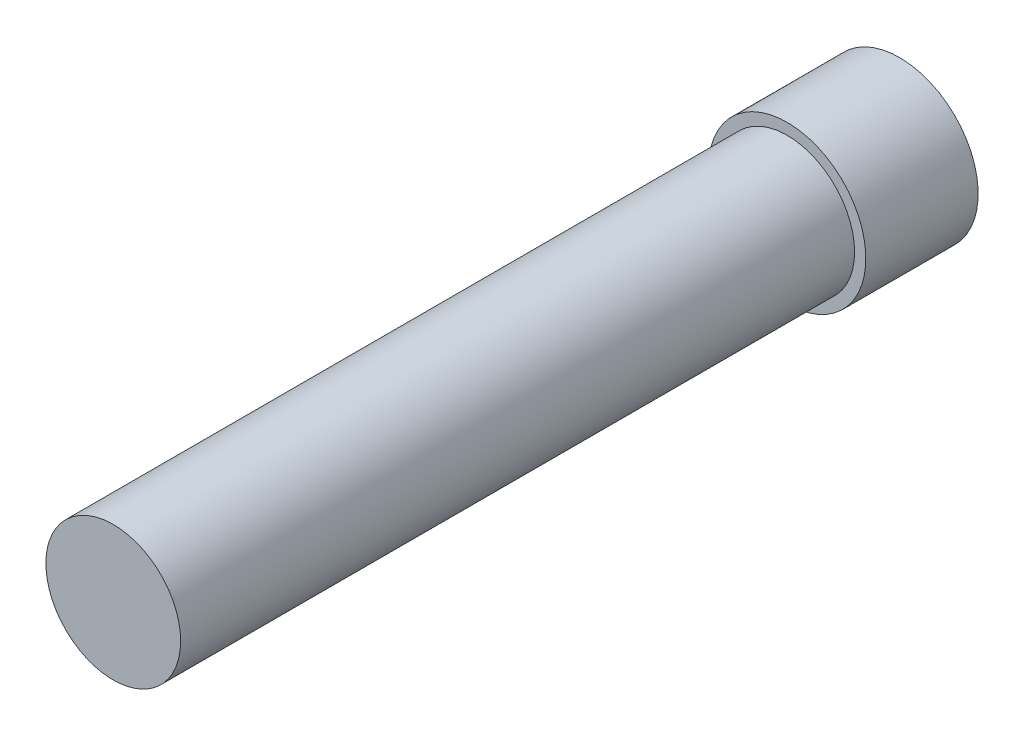
ISO-10303-21;
HEADER;
FILE_DESCRIPTION(('STEP AP214'),'2;1');
FILE_NAME('part.step','',(''),(''),'','','');
FILE_SCHEMA(('AUTOMOTIVE_DESIGN { 1 0 10303 214 1 1 1 1 }'));
ENDSEC;
DATA;
#1=APPLICATION_CONTEXT('core data for automotive mechanical design processes');
#2=APPLICATION_PROTOCOL_DEFINITION('international standard','automotive_design',2000,#1);
#3=PRODUCT_CONTEXT('',#1,'mechanical');
#4=PRODUCT('Part','Part','',(#3));
#5=PRODUCT_RELATED_PRODUCT_CATEGORY('part','',(#4));
#6=PRODUCT_DEFINITION_FORMATION('','',#4);
#7=PRODUCT_DEFINITION_CONTEXT('part definition',#1,'design');
#8=PRODUCT_DEFINITION('design','',#6,#7);
#9=PRODUCT_DEFINITION_SHAPE('','',#8);
#10=(LENGTH_UNIT() NAMED_UNIT(*) SI_UNIT(.MILLI.,.METRE.));
#11=(NAMED_UNIT(*) PLANE_ANGLE_UNIT() SI_UNIT($,.RADIAN.));
#12=(NAMED_UNIT(*) SI_UNIT($,.STERADIAN.) SOLID_ANGLE_UNIT());
#13=UNCERTAINTY_MEASURE_WITH_UNIT(LENGTH_MEASURE(1.E-05),#10,'distance_accuracy_value','');
#14=(GEOMETRIC_REPRESENTATION_CONTEXT(3) GLOBAL_UNCERTAINTY_ASSIGNED_CONTEXT((#13)) GLOBAL_UNIT_ASSIGNED_CONTEXT((#10,
#11,#12)) REPRESENTATION_CONTEXT('',''));
#15=CARTESIAN_POINT('',(0.,0.,0.));
#16=DIRECTION('',(0.,0.,1.));
#17=DIRECTION('',(1.,0.,0.));
#18=AXIS2_PLACEMENT_3D('',#15,#16,#17);
#19=CARTESIAN_POINT('',(0.,0.,30.));
#20=DIRECTION('',(0.,0.,-1.));
#21=DIRECTION('',(-1.,0.,0.));
#22=AXIS2_PLACEMENT_3D('',#19,#20,#21);
#23=CYLINDRICAL_SURFACE('',#22,3.);
#24=CARTESIAN_POINT('',(0.,0.,30.));
#25=DIRECTION('',(0.,0.,1.));
#26=DIRECTION('',(1.,0.,0.));
#27=AXIS2_PLACEMENT_3D('',#24,#25,#26);
#28=CIRCLE('',#27,3.);
#29=CARTESIAN_POINT('',(3.,0.,30.));
#30=VERTEX_POINT('',#29);
#31=EDGE_CURVE('E10',#30,#30,#28,.T.);
#32=ORIENTED_EDGE('',*,*,#31,.F.);
#33=EDGE_LOOP('',(#32));
#34=FACE_BOUND('',#33,.T.);
#35=CARTESIAN_POINT('',(0.,0.,0.));
#36=DIRECTION('',(0.,0.,1.));
#37=DIRECTION('',(1.,0.,0.));
#38=AXIS2_PLACEMENT_3D('',#35,#36,#37);
#39=CIRCLE('',#38,3.);
#40=CARTESIAN_POINT('',(3.,0.,0.));
#41=VERTEX_POINT('',#40);
#42=EDGE_CURVE('E40',#41,#41,#39,.T.);
#43=ORIENTED_EDGE('',*,*,#42,.T.);
#44=EDGE_LOOP('',(#43));
#45=FACE_BOUND('',#44,.T.);
#46=ADVANCED_FACE('F37',(#34,#45),#23,.T.);
#47=CARTESIAN_POINT('',(0.,0.,30.));
#48=DIRECTION('',(0.,0.,1.));
#49=DIRECTION('',(1.,0.,0.));
#50=AXIS2_PLACEMENT_3D('',#47,#48,#49);
#51=PLANE('',#50);
#52=ORIENTED_EDGE('',*,*,#31,.T.);
#53=EDGE_LOOP('',(#52));
#54=FACE_BOUND('',#53,.T.);
#55=ADVANCED_FACE('F64',(#54),#51,.T.);
#56=CARTESIAN_POINT('',(0.,0.,-5.));
#57=DIRECTION('',(0.,0.,1.));
#58=DIRECTION('',(1.,0.,0.));
#59=AXIS2_PLACEMENT_3D('',#56,#57,#58);
#60=CYLINDRICAL_SURFACE('',#59,3.5);
#61=CARTESIAN_POINT('',(0.,0.,-5.));
#62=DIRECTION('',(0.,0.,-1.));
#63=DIRECTION('',(-1.,0.,0.));
#64=AXIS2_PLACEMENT_3D('',#61,#62,#63);
#65=CIRCLE('',#64,3.5);
#66=CARTESIAN_POINT('',(-3.5,0.,-5.));
#67=VERTEX_POINT('',#66);
#68=EDGE_CURVE('E49',#67,#67,#65,.T.);
#69=ORIENTED_EDGE('',*,*,#68,.F.);
#70=EDGE_LOOP('',(#69));
#71=FACE_BOUND('',#70,.T.);
#72=CARTESIAN_POINT('',(0.,0.,0.));
#73=DIRECTION('',(0.,0.,-1.));
#74=DIRECTION('',(-1.,0.,0.));
#75=AXIS2_PLACEMENT_3D('',#72,#73,#74);
#76=CIRCLE('',#75,3.5);
#77=CARTESIAN_POINT('',(-3.5,0.,0.));
#78=VERTEX_POINT('',#77);
#79=EDGE_CURVE('E51',#78,#78,#76,.T.);
#80=ORIENTED_EDGE('',*,*,#79,.T.);
#81=EDGE_LOOP('',(#80));
#82=FACE_BOUND('',#81,.T.);
#83=ADVANCED_FACE('F61',(#71,#82),#60,.T.);
#84=CARTESIAN_POINT('',(0.,0.,-5.));
#85=DIRECTION('',(0.,0.,-1.));
#86=DIRECTION('',(-1.,0.,0.));
#87=AXIS2_PLACEMENT_3D('',#84,#85,#86);
#88=PLANE('',#87);
#89=ORIENTED_EDGE('',*,*,#68,.T.);
#90=EDGE_LOOP('',(#89));
#91=FACE_BOUND('',#90,.T.);
#92=ADVANCED_FACE('F59',(#91),#88,.T.);
#93=CARTESIAN_POINT('',(0.,0.,0.));
#94=DIRECTION('',(0.,0.,-1.));
#95=DIRECTION('',(-1.,0.,0.));
#96=AXIS2_PLACEMENT_3D('',#93,#94,#95);
#97=PLANE('',#96);
#98=ORIENTED_EDGE('',*,*,#42,.F.);
#99=EDGE_LOOP('',(#98));
#100=FACE_BOUND('',#99,.T.);
#101=ORIENTED_EDGE('',*,*,#79,.F.);
#102=EDGE_LOOP('',(#101));
#103=FACE_BOUND('',#102,.T.);
#104=ADVANCED_FACE('F68',(#100,#103),#97,.F.);
#105=CLOSED_SHELL('',(#46,#55,#83,#92,#104));
#106=MANIFOLD_SOLID_BREP('B2',#105);
#107=ADVANCED_BREP_SHAPE_REPRESENTATION('',(#18,#106),#14);
#108=SHAPE_DEFINITION_REPRESENTATION(#9,#107);
ENDSEC;
END-ISO-10303-21;
